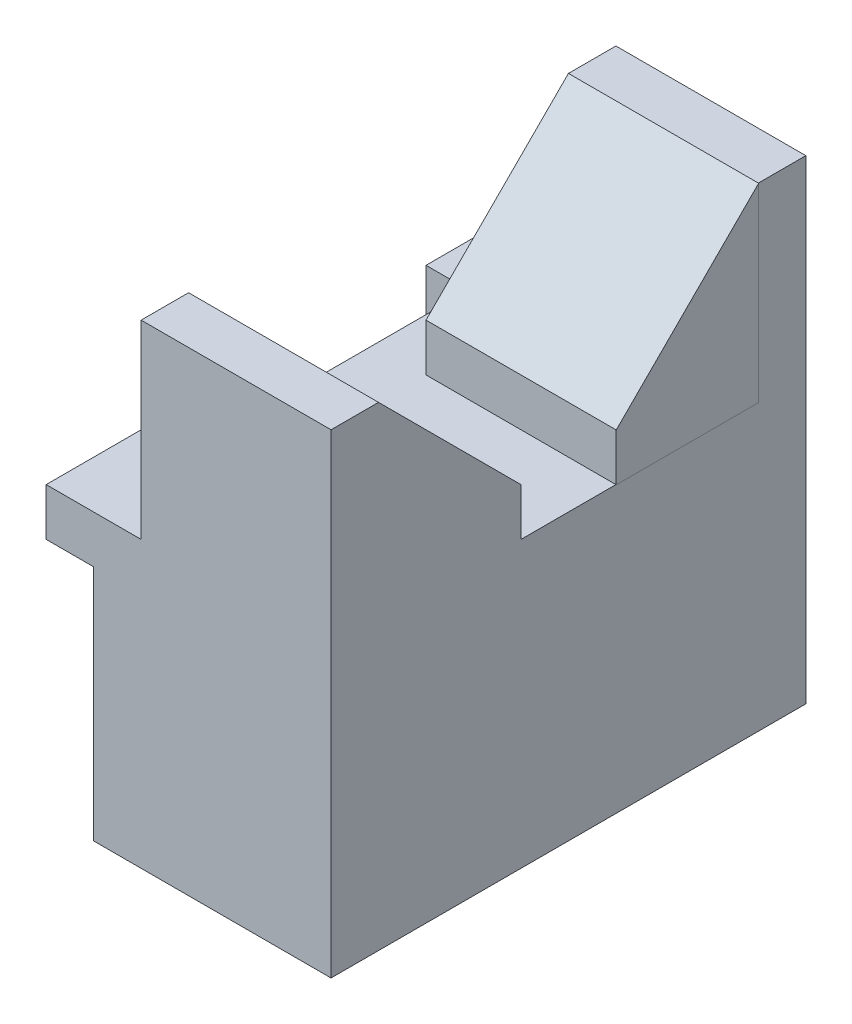
ISO-10303-21;
HEADER;
FILE_DESCRIPTION(('STEP AP214'),'2;1');
FILE_NAME('part.step','',(''),(''),'','','');
FILE_SCHEMA(('AUTOMOTIVE_DESIGN { 1 0 10303 214 1 1 1 1 }'));
ENDSEC;
DATA;
#1=APPLICATION_CONTEXT('core data for automotive mechanical design processes');
#2=APPLICATION_PROTOCOL_DEFINITION('international standard','automotive_design',2000,#1);
#3=PRODUCT_CONTEXT('',#1,'mechanical');
#4=PRODUCT('Part','Part','',(#3));
#5=PRODUCT_RELATED_PRODUCT_CATEGORY('part','',(#4));
#6=PRODUCT_DEFINITION_FORMATION('','',#4);
#7=PRODUCT_DEFINITION_CONTEXT('part definition',#1,'design');
#8=PRODUCT_DEFINITION('design','',#6,#7);
#9=PRODUCT_DEFINITION_SHAPE('','',#8);
#10=(LENGTH_UNIT() NAMED_UNIT(*) SI_UNIT(.MILLI.,.METRE.));
#11=(NAMED_UNIT(*) PLANE_ANGLE_UNIT() SI_UNIT($,.RADIAN.));
#12=(NAMED_UNIT(*) SI_UNIT($,.STERADIAN.) SOLID_ANGLE_UNIT());
#13=UNCERTAINTY_MEASURE_WITH_UNIT(LENGTH_MEASURE(1.E-05),#10,'distance_accuracy_value','');
#14=(GEOMETRIC_REPRESENTATION_CONTEXT(3) GLOBAL_UNCERTAINTY_ASSIGNED_CONTEXT((#13)) GLOBAL_UNIT_ASSIGNED_CONTEXT((#10,
#11,#12)) REPRESENTATION_CONTEXT('',''));
#15=CARTESIAN_POINT('',(0.,0.,0.));
#16=DIRECTION('',(0.,0.,1.));
#17=DIRECTION('',(1.,0.,0.));
#18=AXIS2_PLACEMENT_3D('',#15,#16,#17);
#19=CARTESIAN_POINT('',(0.,30.,0.));
#20=DIRECTION('',(0.,1.,0.));
#21=DIRECTION('',(0.,0.,1.));
#22=AXIS2_PLACEMENT_3D('',#19,#20,#21);
#23=PLANE('',#22);
#24=DIRECTION('',(0.,0.,1.));
#25=VECTOR('',#24,1.);
#26=CARTESIAN_POINT('',(5.00000000000001,30.,35.));
#27=LINE('',#26,#25);
#28=CARTESIAN_POINT('',(5.00000000000001,30.,30.));
#29=VERTEX_POINT('',#28);
#30=CARTESIAN_POINT('',(5.00000000000001,30.,50.));
#31=VERTEX_POINT('',#30);
#32=EDGE_CURVE('E204',#29,#31,#27,.T.);
#33=ORIENTED_EDGE('',*,*,#32,.F.);
#34=DIRECTION('',(-1.,0.,0.));
#35=VECTOR('',#34,1.);
#36=CARTESIAN_POINT('',(25.,30.,30.));
#37=LINE('',#36,#35);
#38=CARTESIAN_POINT('',(25.,30.,30.));
#39=VERTEX_POINT('',#38);
#40=EDGE_CURVE('E375',#39,#29,#37,.T.);
#41=ORIENTED_EDGE('',*,*,#40,.F.);
#42=DIRECTION('',(0.,0.,-1.));
#43=VECTOR('',#42,1.);
#44=CARTESIAN_POINT('',(25.,30.,0.));
#45=LINE('',#44,#43);
#46=CARTESIAN_POINT('',(25.,30.,20.));
#47=VERTEX_POINT('',#46);
#48=EDGE_CURVE('E320',#39,#47,#45,.T.);
#49=ORIENTED_EDGE('',*,*,#48,.T.);
#50=DIRECTION('',(1.,0.,0.));
#51=VECTOR('',#50,1.);
#52=CARTESIAN_POINT('',(5.00000000000001,30.,20.));
#53=LINE('',#52,#51);
#54=CARTESIAN_POINT('',(5.00000000000001,30.,20.));
#55=VERTEX_POINT('',#54);
#56=EDGE_CURVE('E373',#55,#47,#53,.T.);
#57=ORIENTED_EDGE('',*,*,#56,.F.);
#58=DIRECTION('',(0.,0.,1.));
#59=VECTOR('',#58,1.);
#60=CARTESIAN_POINT('',(5.00000000000001,30.,0.));
#61=LINE('',#60,#59);
#62=CARTESIAN_POINT('',(5.00000000000001,30.,0.));
#63=VERTEX_POINT('',#62);
#64=EDGE_CURVE('E197',#63,#55,#61,.T.);
#65=ORIENTED_EDGE('',*,*,#64,.F.);
#66=DIRECTION('',(-1.,0.,0.));
#67=VECTOR('',#66,1.);
#68=CARTESIAN_POINT('',(0.,30.,0.));
#69=LINE('',#68,#67);
#70=CARTESIAN_POINT('',(-5.,30.,0.));
#71=VERTEX_POINT('',#70);
#72=EDGE_CURVE('E323',#63,#71,#69,.T.);
#73=ORIENTED_EDGE('',*,*,#72,.T.);
#74=DIRECTION('',(0.,0.,1.));
#75=VECTOR('',#74,1.);
#76=CARTESIAN_POINT('',(-5.,30.,0.));
#77=LINE('',#76,#75);
#78=CARTESIAN_POINT('',(-5.,30.,10.));
#79=VERTEX_POINT('',#78);
#80=EDGE_CURVE('E290',#71,#79,#77,.T.);
#81=ORIENTED_EDGE('',*,*,#80,.T.);
#82=DIRECTION('',(1.,0.,0.));
#83=VECTOR('',#82,1.);
#84=CARTESIAN_POINT('',(-5.,30.,10.));
#85=LINE('',#84,#83);
#86=CARTESIAN_POINT('',(-0.5,30.,10.));
#87=VERTEX_POINT('',#86);
#88=EDGE_CURVE('E293',#79,#87,#85,.T.);
#89=ORIENTED_EDGE('',*,*,#88,.T.);
#90=DIRECTION('',(0.,0.,-1.));
#91=VECTOR('',#90,1.);
#92=CARTESIAN_POINT('',(-0.499999999999999,30.,10.));
#93=LINE('',#92,#91);
#94=CARTESIAN_POINT('',(-0.499999999999995,30.,40.));
#95=VERTEX_POINT('',#94);
#96=EDGE_CURVE('E255',#95,#87,#93,.T.);
#97=ORIENTED_EDGE('',*,*,#96,.F.);
#98=DIRECTION('',(-1.,0.,0.));
#99=VECTOR('',#98,1.);
#100=CARTESIAN_POINT('',(0.,30.,40.));
#101=LINE('',#100,#99);
#102=CARTESIAN_POINT('',(-5.,30.,40.));
#103=VERTEX_POINT('',#102);
#104=EDGE_CURVE('E263',#95,#103,#101,.T.);
#105=ORIENTED_EDGE('',*,*,#104,.T.);
#106=DIRECTION('',(0.,0.,1.));
#107=VECTOR('',#106,1.);
#108=CARTESIAN_POINT('',(-5.,30.,50.));
#109=LINE('',#108,#107);
#110=CARTESIAN_POINT('',(-5.,30.,50.));
#111=VERTEX_POINT('',#110);
#112=EDGE_CURVE('E268',#103,#111,#109,.T.);
#113=ORIENTED_EDGE('',*,*,#112,.T.);
#114=DIRECTION('',(1.,0.,0.));
#115=VECTOR('',#114,1.);
#116=CARTESIAN_POINT('',(0.,30.,50.));
#117=LINE('',#116,#115);
#118=EDGE_CURVE('E317',#111,#31,#117,.T.);
#119=ORIENTED_EDGE('',*,*,#118,.T.);
#120=EDGE_LOOP('',(#33,#41,#49,#57,#65,#73,#81,#89,#97,#105,#113,#119));
#121=FACE_BOUND('',#120,.T.);
#122=ADVANCED_FACE('F39',(#121),#23,.T.);
#123=CARTESIAN_POINT('',(0.,25.,0.));
#124=DIRECTION('',(1.,0.,0.));
#125=DIRECTION('',(0.,0.,-1.));
#126=AXIS2_PLACEMENT_3D('',#123,#124,#125);
#127=PLANE('',#126);
#128=DIRECTION('',(0.,-1.,0.));
#129=VECTOR('',#128,1.);
#130=CARTESIAN_POINT('',(0.,25.,50.));
#131=LINE('',#130,#129);
#132=CARTESIAN_POINT('',(0.,25.,50.));
#133=VERTEX_POINT('',#132);
#134=CARTESIAN_POINT('',(0.,0.,50.));
#135=VERTEX_POINT('',#134);
#136=EDGE_CURVE('E351',#133,#135,#131,.T.);
#137=ORIENTED_EDGE('',*,*,#136,.F.);
#138=DIRECTION('',(0.,0.,-1.));
#139=VECTOR('',#138,1.);
#140=CARTESIAN_POINT('',(0.,25.,0.));
#141=LINE('',#140,#139);
#142=CARTESIAN_POINT('',(0.,25.,0.));
#143=VERTEX_POINT('',#142);
#144=EDGE_CURVE('E286',#133,#143,#141,.T.);
#145=ORIENTED_EDGE('',*,*,#144,.T.);
#146=DIRECTION('',(0.,-1.,0.));
#147=VECTOR('',#146,1.);
#148=CARTESIAN_POINT('',(0.,25.,0.));
#149=LINE('',#148,#147);
#150=CARTESIAN_POINT('',(0.,0.,0.));
#151=VERTEX_POINT('',#150);
#152=EDGE_CURVE('E341',#143,#151,#149,.T.);
#153=ORIENTED_EDGE('',*,*,#152,.T.);
#154=DIRECTION('',(0.,0.,1.));
#155=VECTOR('',#154,1.);
#156=CARTESIAN_POINT('',(0.,0.,0.));
#157=LINE('',#156,#155);
#158=EDGE_CURVE('E326',#151,#135,#157,.T.);
#159=ORIENTED_EDGE('',*,*,#158,.T.);
#160=EDGE_LOOP('',(#137,#145,#153,#159));
#161=FACE_BOUND('',#160,.T.);
#162=ADVANCED_FACE('F41',(#161),#127,.F.);
#163=CARTESIAN_POINT('',(0.,25.,50.));
#164=DIRECTION('',(0.,0.,-1.));
#165=DIRECTION('',(-1.,0.,0.));
#166=AXIS2_PLACEMENT_3D('',#163,#164,#165);
#167=PLANE('',#166);
#168=DIRECTION('',(0.,-1.,0.));
#169=VECTOR('',#168,1.);
#170=CARTESIAN_POINT('',(5.00000000000001,50.,50.));
#171=LINE('',#170,#169);
#172=CARTESIAN_POINT('',(5.00000000000001,50.,50.));
#173=VERTEX_POINT('',#172);
#174=EDGE_CURVE('E221',#173,#31,#171,.T.);
#175=ORIENTED_EDGE('',*,*,#174,.T.);
#176=ORIENTED_EDGE('',*,*,#118,.F.);
#177=DIRECTION('',(0.,1.,0.));
#178=VECTOR('',#177,1.);
#179=CARTESIAN_POINT('',(-5.,25.,50.));
#180=LINE('',#179,#178);
#181=CARTESIAN_POINT('',(-5.,25.,50.));
#182=VERTEX_POINT('',#181);
#183=EDGE_CURVE('E282',#182,#111,#180,.T.);
#184=ORIENTED_EDGE('',*,*,#183,.F.);
#185=DIRECTION('',(1.,0.,0.));
#186=VECTOR('',#185,1.);
#187=CARTESIAN_POINT('',(0.,25.,50.));
#188=LINE('',#187,#186);
#189=EDGE_CURVE('E272',#182,#133,#188,.T.);
#190=ORIENTED_EDGE('',*,*,#189,.T.);
#191=ORIENTED_EDGE('',*,*,#136,.T.);
#192=DIRECTION('',(1.,0.,0.));
#193=VECTOR('',#192,1.);
#194=CARTESIAN_POINT('',(0.,0.,50.));
#195=LINE('',#194,#193);
#196=CARTESIAN_POINT('',(25.,0.,50.));
#197=VERTEX_POINT('',#196);
#198=EDGE_CURVE('E330',#135,#197,#195,.T.);
#199=ORIENTED_EDGE('',*,*,#198,.T.);
#200=DIRECTION('',(0.,-1.,0.));
#201=VECTOR('',#200,1.);
#202=CARTESIAN_POINT('',(25.,25.,50.));
#203=LINE('',#202,#201);
#204=CARTESIAN_POINT('',(25.,50.,50.));
#205=VERTEX_POINT('',#204);
#206=EDGE_CURVE('E348',#205,#197,#203,.T.);
#207=ORIENTED_EDGE('',*,*,#206,.F.);
#208=DIRECTION('',(1.,0.,0.));
#209=VECTOR('',#208,1.);
#210=CARTESIAN_POINT('',(25.,50.,50.));
#211=LINE('',#210,#209);
#212=EDGE_CURVE('E217',#173,#205,#211,.T.);
#213=ORIENTED_EDGE('',*,*,#212,.F.);
#214=EDGE_LOOP('',(#175,#176,#184,#190,#191,#199,#207,#213));
#215=FACE_BOUND('',#214,.T.);
#216=ADVANCED_FACE('F426',(#215),#167,.F.);
#217=CARTESIAN_POINT('',(25.,25.,0.));
#218=DIRECTION('',(-1.,0.,0.));
#219=DIRECTION('',(0.,0.,1.));
#220=AXIS2_PLACEMENT_3D('',#217,#218,#219);
#221=PLANE('',#220);
#222=DIRECTION('',(0.,-1.,0.));
#223=VECTOR('',#222,1.);
#224=CARTESIAN_POINT('',(25.,50.,30.));
#225=LINE('',#224,#223);
#226=CARTESIAN_POINT('',(25.,35.,30.));
#227=VERTEX_POINT('',#226);
#228=EDGE_CURVE('E359',#227,#39,#225,.T.);
#229=ORIENTED_EDGE('',*,*,#228,.F.);
#230=DIRECTION('',(0.,0.707106781186547,0.707106781186548));
#231=VECTOR('',#230,1.);
#232=CARTESIAN_POINT('',(25.,15.,9.99999999999999));
#233=LINE('',#232,#231);
#234=CARTESIAN_POINT('',(25.,50.,45.));
#235=VERTEX_POINT('',#234);
#236=EDGE_CURVE('E62',#227,#235,#233,.T.);
#237=ORIENTED_EDGE('',*,*,#236,.T.);
#238=DIRECTION('',(0.,0.,-1.));
#239=VECTOR('',#238,1.);
#240=CARTESIAN_POINT('',(25.,50.,35.));
#241=LINE('',#240,#239);
#242=EDGE_CURVE('E210',#205,#235,#241,.T.);
#243=ORIENTED_EDGE('',*,*,#242,.F.);
#244=ORIENTED_EDGE('',*,*,#206,.T.);
#245=DIRECTION('',(0.,0.,-1.));
#246=VECTOR('',#245,1.);
#247=CARTESIAN_POINT('',(25.,0.,0.));
#248=LINE('',#247,#246);
#249=CARTESIAN_POINT('',(25.,0.,0.));
#250=VERTEX_POINT('',#249);
#251=EDGE_CURVE('E334',#197,#250,#248,.T.);
#252=ORIENTED_EDGE('',*,*,#251,.T.);
#253=DIRECTION('',(0.,-1.,0.));
#254=VECTOR('',#253,1.);
#255=CARTESIAN_POINT('',(25.,25.,0.));
#256=LINE('',#255,#254);
#257=CARTESIAN_POINT('',(25.,50.,0.));
#258=VERTEX_POINT('',#257);
#259=EDGE_CURVE('E344',#258,#250,#256,.T.);
#260=ORIENTED_EDGE('',*,*,#259,.F.);
#261=DIRECTION('',(0.,0.,-1.));
#262=VECTOR('',#261,1.);
#263=CARTESIAN_POINT('',(25.,50.,0.));
#264=LINE('',#263,#262);
#265=CARTESIAN_POINT('',(25.,50.,5.));
#266=VERTEX_POINT('',#265);
#267=EDGE_CURVE('E228',#266,#258,#264,.T.);
#268=ORIENTED_EDGE('',*,*,#267,.F.);
#269=DIRECTION('',(0.,-1.,0.));
#270=VECTOR('',#269,1.);
#271=CARTESIAN_POINT('',(25.,50.,5.));
#272=LINE('',#271,#270);
#273=CARTESIAN_POINT('',(25.,30.,5.));
#274=VERTEX_POINT('',#273);
#275=EDGE_CURVE('E238',#266,#274,#272,.T.);
#276=ORIENTED_EDGE('',*,*,#275,.T.);
#277=DIRECTION('',(0.,0.,-1.));
#278=VECTOR('',#277,1.);
#279=CARTESIAN_POINT('',(25.,30.,0.));
#280=LINE('',#279,#278);
#281=EDGE_CURVE('E200',#47,#274,#280,.T.);
#282=ORIENTED_EDGE('',*,*,#281,.F.);
#283=ORIENTED_EDGE('',*,*,#48,.F.);
#284=EDGE_LOOP('',(#229,#237,#243,#244,#252,#260,#268,#276,#282,#283));
#285=FACE_BOUND('',#284,.T.);
#286=ADVANCED_FACE('F365',(#285),#221,.F.);
#287=CARTESIAN_POINT('',(0.,25.,0.));
#288=DIRECTION('',(0.,0.,1.));
#289=DIRECTION('',(1.,0.,0.));
#290=AXIS2_PLACEMENT_3D('',#287,#288,#289);
#291=PLANE('',#290);
#292=DIRECTION('',(-1.,0.,0.));
#293=VECTOR('',#292,1.);
#294=CARTESIAN_POINT('',(0.,0.,0.));
#295=LINE('',#294,#293);
#296=EDGE_CURVE('E337',#250,#151,#295,.T.);
#297=ORIENTED_EDGE('',*,*,#296,.T.);
#298=ORIENTED_EDGE('',*,*,#152,.F.);
#299=DIRECTION('',(-1.,0.,0.));
#300=VECTOR('',#299,1.);
#301=CARTESIAN_POINT('',(0.,25.,0.));
#302=LINE('',#301,#300);
#303=CARTESIAN_POINT('',(-5.,25.,0.));
#304=VERTEX_POINT('',#303);
#305=EDGE_CURVE('E302',#143,#304,#302,.T.);
#306=ORIENTED_EDGE('',*,*,#305,.T.);
#307=DIRECTION('',(0.,-1.,0.));
#308=VECTOR('',#307,1.);
#309=CARTESIAN_POINT('',(-5.,30.,0.));
#310=LINE('',#309,#308);
#311=EDGE_CURVE('E313',#71,#304,#310,.T.);
#312=ORIENTED_EDGE('',*,*,#311,.F.);
#313=ORIENTED_EDGE('',*,*,#72,.F.);
#314=DIRECTION('',(0.,-1.,0.));
#315=VECTOR('',#314,1.);
#316=CARTESIAN_POINT('',(5.00000000000001,50.,0.));
#317=LINE('',#316,#315);
#318=CARTESIAN_POINT('',(5.00000000000001,50.,0.));
#319=VERTEX_POINT('',#318);
#320=EDGE_CURVE('E244',#319,#63,#317,.T.);
#321=ORIENTED_EDGE('',*,*,#320,.F.);
#322=DIRECTION('',(-1.,0.,0.));
#323=VECTOR('',#322,1.);
#324=CARTESIAN_POINT('',(25.,50.,0.));
#325=LINE('',#324,#323);
#326=EDGE_CURVE('E232',#258,#319,#325,.T.);
#327=ORIENTED_EDGE('',*,*,#326,.F.);
#328=ORIENTED_EDGE('',*,*,#259,.T.);
#329=EDGE_LOOP('',(#297,#298,#306,#312,#313,#321,#327,#328));
#330=FACE_BOUND('',#329,.T.);
#331=ADVANCED_FACE('F438',(#330),#291,.F.);
#332=CARTESIAN_POINT('',(0.,0.,0.));
#333=DIRECTION('',(0.,1.,0.));
#334=DIRECTION('',(0.,0.,1.));
#335=AXIS2_PLACEMENT_3D('',#332,#333,#334);
#336=PLANE('',#335);
#337=ORIENTED_EDGE('',*,*,#158,.F.);
#338=ORIENTED_EDGE('',*,*,#296,.F.);
#339=ORIENTED_EDGE('',*,*,#251,.F.);
#340=ORIENTED_EDGE('',*,*,#198,.F.);
#341=EDGE_LOOP('',(#337,#338,#339,#340));
#342=FACE_BOUND('',#341,.T.);
#343=ADVANCED_FACE('F435',(#342),#336,.F.);
#344=CARTESIAN_POINT('',(-5.,30.,0.));
#345=DIRECTION('',(1.,0.,0.));
#346=DIRECTION('',(0.,0.,-1.));
#347=AXIS2_PLACEMENT_3D('',#344,#345,#346);
#348=PLANE('',#347);
#349=DIRECTION('',(0.,0.,1.));
#350=VECTOR('',#349,1.);
#351=CARTESIAN_POINT('',(-5.,25.,0.));
#352=LINE('',#351,#350);
#353=CARTESIAN_POINT('',(-5.,25.,10.));
#354=VERTEX_POINT('',#353);
#355=EDGE_CURVE('E305',#304,#354,#352,.T.);
#356=ORIENTED_EDGE('',*,*,#355,.T.);
#357=DIRECTION('',(0.,-1.,0.));
#358=VECTOR('',#357,1.);
#359=CARTESIAN_POINT('',(-5.,30.,10.));
#360=LINE('',#359,#358);
#361=EDGE_CURVE('E298',#79,#354,#360,.T.);
#362=ORIENTED_EDGE('',*,*,#361,.F.);
#363=ORIENTED_EDGE('',*,*,#80,.F.);
#364=ORIENTED_EDGE('',*,*,#311,.T.);
#365=EDGE_LOOP('',(#356,#362,#363,#364));
#366=FACE_BOUND('',#365,.T.);
#367=ADVANCED_FACE('F446',(#366),#348,.F.);
#368=CARTESIAN_POINT('',(-5.,30.,10.));
#369=DIRECTION('',(0.,0.,-1.));
#370=DIRECTION('',(-1.,0.,0.));
#371=AXIS2_PLACEMENT_3D('',#368,#369,#370);
#372=PLANE('',#371);
#373=DIRECTION('',(1.,0.,0.));
#374=VECTOR('',#373,1.);
#375=CARTESIAN_POINT('',(-5.,25.,10.));
#376=LINE('',#375,#374);
#377=CARTESIAN_POINT('',(-0.499999999999999,25.,10.));
#378=VERTEX_POINT('',#377);
#379=EDGE_CURVE('E294',#354,#378,#376,.T.);
#380=ORIENTED_EDGE('',*,*,#379,.T.);
#381=DIRECTION('',(0.,-1.,0.));
#382=VECTOR('',#381,1.);
#383=CARTESIAN_POINT('',(-0.499999999999999,30.,10.));
#384=LINE('',#383,#382);
#385=EDGE_CURVE('E247',#87,#378,#384,.T.);
#386=ORIENTED_EDGE('',*,*,#385,.F.);
#387=ORIENTED_EDGE('',*,*,#88,.F.);
#388=ORIENTED_EDGE('',*,*,#361,.T.);
#389=EDGE_LOOP('',(#380,#386,#387,#388));
#390=FACE_BOUND('',#389,.T.);
#391=ADVANCED_FACE('F450',(#390),#372,.F.);
#392=CARTESIAN_POINT('',(0.,25.,0.));
#393=DIRECTION('',(0.,1.,0.));
#394=DIRECTION('',(0.,0.,1.));
#395=AXIS2_PLACEMENT_3D('',#392,#393,#394);
#396=PLANE('',#395);
#397=ORIENTED_EDGE('',*,*,#144,.F.);
#398=ORIENTED_EDGE('',*,*,#189,.F.);
#399=DIRECTION('',(0.,0.,1.));
#400=VECTOR('',#399,1.);
#401=CARTESIAN_POINT('',(-5.,25.,50.));
#402=LINE('',#401,#400);
#403=CARTESIAN_POINT('',(-5.,25.,40.));
#404=VERTEX_POINT('',#403);
#405=EDGE_CURVE('E267',#404,#182,#402,.T.);
#406=ORIENTED_EDGE('',*,*,#405,.F.);
#407=DIRECTION('',(-1.,0.,0.));
#408=VECTOR('',#407,1.);
#409=CARTESIAN_POINT('',(0.,25.,40.));
#410=LINE('',#409,#408);
#411=CARTESIAN_POINT('',(-0.499999999999995,25.,40.));
#412=VERTEX_POINT('',#411);
#413=EDGE_CURVE('E264',#412,#404,#410,.T.);
#414=ORIENTED_EDGE('',*,*,#413,.F.);
#415=DIRECTION('',(0.,0.,1.));
#416=VECTOR('',#415,1.);
#417=CARTESIAN_POINT('',(-0.499999999999999,25.,10.));
#418=LINE('',#417,#416);
#419=EDGE_CURVE('E251',#378,#412,#418,.T.);
#420=ORIENTED_EDGE('',*,*,#419,.F.);
#421=ORIENTED_EDGE('',*,*,#379,.F.);
#422=ORIENTED_EDGE('',*,*,#355,.F.);
#423=ORIENTED_EDGE('',*,*,#305,.F.);
#424=EDGE_LOOP('',(#397,#398,#406,#414,#420,#421,#422,#423));
#425=FACE_BOUND('',#424,.T.);
#426=ADVANCED_FACE('F465',(#425),#396,.F.);
#427=CARTESIAN_POINT('',(-5.,25.,50.));
#428=DIRECTION('',(-1.,0.,0.));
#429=DIRECTION('',(0.,0.,1.));
#430=AXIS2_PLACEMENT_3D('',#427,#428,#429);
#431=PLANE('',#430);
#432=ORIENTED_EDGE('',*,*,#112,.F.);
#433=DIRECTION('',(0.,1.,0.));
#434=VECTOR('',#433,1.);
#435=CARTESIAN_POINT('',(-5.,25.,40.));
#436=LINE('',#435,#434);
#437=EDGE_CURVE('E276',#404,#103,#436,.T.);
#438=ORIENTED_EDGE('',*,*,#437,.F.);
#439=ORIENTED_EDGE('',*,*,#405,.T.);
#440=ORIENTED_EDGE('',*,*,#183,.T.);
#441=EDGE_LOOP('',(#432,#438,#439,#440));
#442=FACE_BOUND('',#441,.T.);
#443=ADVANCED_FACE('F461',(#442),#431,.T.);
#444=CARTESIAN_POINT('',(0.,25.,40.));
#445=DIRECTION('',(0.,0.,-1.));
#446=DIRECTION('',(-1.,0.,0.));
#447=AXIS2_PLACEMENT_3D('',#444,#445,#446);
#448=PLANE('',#447);
#449=DIRECTION('',(0.,1.,0.));
#450=VECTOR('',#449,1.);
#451=CARTESIAN_POINT('',(-0.499999999999995,25.,40.));
#452=LINE('',#451,#450);
#453=EDGE_CURVE('E259',#412,#95,#452,.T.);
#454=ORIENTED_EDGE('',*,*,#453,.F.);
#455=ORIENTED_EDGE('',*,*,#413,.T.);
#456=ORIENTED_EDGE('',*,*,#437,.T.);
#457=ORIENTED_EDGE('',*,*,#104,.F.);
#458=EDGE_LOOP('',(#454,#455,#456,#457));
#459=FACE_BOUND('',#458,.T.);
#460=ADVANCED_FACE('F457',(#459),#448,.T.);
#461=CARTESIAN_POINT('',(-0.5,0.,0.));
#462=DIRECTION('',(-1.,0.,0.));
#463=DIRECTION('',(0.,0.,1.));
#464=AXIS2_PLACEMENT_3D('',#461,#462,#463);
#465=PLANE('',#464);
#466=ORIENTED_EDGE('',*,*,#419,.T.);
#467=ORIENTED_EDGE('',*,*,#453,.T.);
#468=ORIENTED_EDGE('',*,*,#96,.T.);
#469=ORIENTED_EDGE('',*,*,#385,.T.);
#470=EDGE_LOOP('',(#466,#467,#468,#469));
#471=FACE_BOUND('',#470,.T.);
#472=ADVANCED_FACE('F453',(#471),#465,.T.);
#473=CARTESIAN_POINT('',(5.00000000000001,50.,0.));
#474=DIRECTION('',(1.,0.,0.));
#475=DIRECTION('',(0.,0.,-1.));
#476=AXIS2_PLACEMENT_3D('',#473,#474,#475);
#477=PLANE('',#476);
#478=DIRECTION('',(0.,-1.,0.));
#479=VECTOR('',#478,1.);
#480=CARTESIAN_POINT('',(5.00000000000001,50.,20.));
#481=LINE('',#480,#479);
#482=CARTESIAN_POINT('',(5.00000000000001,35.,20.));
#483=VERTEX_POINT('',#482);
#484=EDGE_CURVE('E189',#483,#55,#481,.T.);
#485=ORIENTED_EDGE('',*,*,#484,.F.);
#486=DIRECTION('',(0.,-0.707106781186548,0.707106781186547));
#487=VECTOR('',#486,1.);
#488=CARTESIAN_POINT('',(5.00000000000001,35.,20.));
#489=LINE('',#488,#487);
#490=CARTESIAN_POINT('',(5.00000000000001,50.,5.));
#491=VERTEX_POINT('',#490);
#492=EDGE_CURVE('E174',#491,#483,#489,.T.);
#493=ORIENTED_EDGE('',*,*,#492,.F.);
#494=DIRECTION('',(0.,0.,1.));
#495=VECTOR('',#494,1.);
#496=CARTESIAN_POINT('',(5.00000000000001,50.,0.));
#497=LINE('',#496,#495);
#498=EDGE_CURVE('E235',#319,#491,#497,.T.);
#499=ORIENTED_EDGE('',*,*,#498,.F.);
#500=ORIENTED_EDGE('',*,*,#320,.T.);
#501=ORIENTED_EDGE('',*,*,#64,.T.);
#502=EDGE_LOOP('',(#485,#493,#499,#500,#501));
#503=FACE_BOUND('',#502,.T.);
#504=ADVANCED_FACE('F195',(#503),#477,.F.);
#505=CARTESIAN_POINT('',(0.,50.,0.));
#506=DIRECTION('',(0.,-1.,0.));
#507=DIRECTION('',(0.,0.,-1.));
#508=AXIS2_PLACEMENT_3D('',#505,#506,#507);
#509=PLANE('',#508);
#510=ORIENTED_EDGE('',*,*,#498,.T.);
#511=DIRECTION('',(-1.,0.,0.));
#512=VECTOR('',#511,1.);
#513=CARTESIAN_POINT('',(35.,50.,5.));
#514=LINE('',#513,#512);
#515=EDGE_CURVE('E177',#266,#491,#514,.T.);
#516=ORIENTED_EDGE('',*,*,#515,.F.);
#517=ORIENTED_EDGE('',*,*,#267,.T.);
#518=ORIENTED_EDGE('',*,*,#326,.T.);
#519=EDGE_LOOP('',(#510,#516,#517,#518));
#520=FACE_BOUND('',#519,.T.);
#521=ADVANCED_FACE('F405',(#520),#509,.F.);
#522=CARTESIAN_POINT('',(5.00000000000001,50.,35.));
#523=DIRECTION('',(1.,0.,0.));
#524=DIRECTION('',(0.,0.,-1.));
#525=AXIS2_PLACEMENT_3D('',#522,#523,#524);
#526=PLANE('',#525);
#527=DIRECTION('',(0.,0.,1.));
#528=VECTOR('',#527,1.);
#529=CARTESIAN_POINT('',(5.00000000000001,50.,35.));
#530=LINE('',#529,#528);
#531=CARTESIAN_POINT('',(5.00000000000001,50.,45.));
#532=VERTEX_POINT('',#531);
#533=EDGE_CURVE('E214',#532,#173,#530,.T.);
#534=ORIENTED_EDGE('',*,*,#533,.F.);
#535=DIRECTION('',(0.,0.707106781186547,0.707106781186548));
#536=VECTOR('',#535,1.);
#537=CARTESIAN_POINT('',(5.00000000000001,50.,45.));
#538=LINE('',#537,#536);
#539=CARTESIAN_POINT('',(5.00000000000001,35.,30.));
#540=VERTEX_POINT('',#539);
#541=EDGE_CURVE('E412',#540,#532,#538,.T.);
#542=ORIENTED_EDGE('',*,*,#541,.F.);
#543=DIRECTION('',(0.,-1.,0.));
#544=VECTOR('',#543,1.);
#545=CARTESIAN_POINT('',(5.00000000000001,50.,30.));
#546=LINE('',#545,#544);
#547=EDGE_CURVE('E361',#540,#29,#546,.T.);
#548=ORIENTED_EDGE('',*,*,#547,.T.);
#549=ORIENTED_EDGE('',*,*,#32,.T.);
#550=ORIENTED_EDGE('',*,*,#174,.F.);
#551=EDGE_LOOP('',(#534,#542,#548,#549,#550));
#552=FACE_BOUND('',#551,.T.);
#553=ADVANCED_FACE('F423',(#552),#526,.F.);
#554=CARTESIAN_POINT('',(0.,50.,0.));
#555=DIRECTION('',(0.,-1.,0.));
#556=DIRECTION('',(0.,0.,-1.));
#557=AXIS2_PLACEMENT_3D('',#554,#555,#556);
#558=PLANE('',#557);
#559=ORIENTED_EDGE('',*,*,#242,.T.);
#560=DIRECTION('',(-1.,0.,0.));
#561=VECTOR('',#560,1.);
#562=CARTESIAN_POINT('',(35.,50.,45.));
#563=LINE('',#562,#561);
#564=EDGE_CURVE('E183',#235,#532,#563,.T.);
#565=ORIENTED_EDGE('',*,*,#564,.T.);
#566=ORIENTED_EDGE('',*,*,#533,.T.);
#567=ORIENTED_EDGE('',*,*,#212,.T.);
#568=EDGE_LOOP('',(#559,#565,#566,#567));
#569=FACE_BOUND('',#568,.T.);
#570=ADVANCED_FACE('F428',(#569),#558,.F.);
#571=CARTESIAN_POINT('',(0.,30.,0.));
#572=DIRECTION('',(0.,1.,0.));
#573=DIRECTION('',(0.,0.,1.));
#574=AXIS2_PLACEMENT_3D('',#571,#572,#573);
#575=PLANE('',#574);
#576=CARTESIAN_POINT('',(25.0346411961004,30.,20.));
#577=VERTEX_POINT('',#576);
#578=EDGE_CURVE('E369',#47,#577,#53,.T.);
#579=ORIENTED_EDGE('',*,*,#578,.F.);
#580=ORIENTED_EDGE('',*,*,#281,.T.);
#581=DIRECTION('',(-1.,0.,0.));
#582=VECTOR('',#581,1.);
#583=CARTESIAN_POINT('',(5.00000000000001,30.,5.));
#584=LINE('',#583,#582);
#585=CARTESIAN_POINT('',(25.0346411961004,30.,5.));
#586=VERTEX_POINT('',#585);
#587=EDGE_CURVE('E381',#586,#274,#584,.T.);
#588=ORIENTED_EDGE('',*,*,#587,.F.);
#589=DIRECTION('',(0.,0.,-1.));
#590=VECTOR('',#589,1.);
#591=CARTESIAN_POINT('',(25.0346411961004,30.,5.));
#592=LINE('',#591,#590);
#593=EDGE_CURVE('E384',#577,#586,#592,.T.);
#594=ORIENTED_EDGE('',*,*,#593,.F.);
#595=EDGE_LOOP('',(#579,#580,#588,#594));
#596=FACE_BOUND('',#595,.T.);
#597=ADVANCED_FACE('F401',(#596),#575,.F.);
#598=CARTESIAN_POINT('',(5.00000000000001,50.,5.));
#599=DIRECTION('',(0.,0.,1.));
#600=DIRECTION('',(1.,0.,0.));
#601=AXIS2_PLACEMENT_3D('',#598,#599,#600);
#602=PLANE('',#601);
#603=ORIENTED_EDGE('',*,*,#587,.T.);
#604=ORIENTED_EDGE('',*,*,#275,.F.);
#605=DIRECTION('',(-1.,0.,0.));
#606=VECTOR('',#605,1.);
#607=CARTESIAN_POINT('',(5.00000000000001,50.,5.));
#608=LINE('',#607,#606);
#609=CARTESIAN_POINT('',(25.0346411961004,50.,5.));
#610=VERTEX_POINT('',#609);
#611=EDGE_CURVE('E379',#610,#266,#608,.T.);
#612=ORIENTED_EDGE('',*,*,#611,.F.);
#613=DIRECTION('',(0.,-1.,0.));
#614=VECTOR('',#613,1.);
#615=CARTESIAN_POINT('',(25.0346411961004,50.,5.));
#616=LINE('',#615,#614);
#617=EDGE_CURVE('E206',#610,#586,#616,.T.);
#618=ORIENTED_EDGE('',*,*,#617,.T.);
#619=EDGE_LOOP('',(#603,#604,#612,#618));
#620=FACE_BOUND('',#619,.T.);
#621=ADVANCED_FACE('F395',(#620),#602,.F.);
#622=CARTESIAN_POINT('',(5.00000000000001,50.,20.));
#623=DIRECTION('',(0.,0.,-1.));
#624=DIRECTION('',(-1.,0.,0.));
#625=AXIS2_PLACEMENT_3D('',#622,#623,#624);
#626=PLANE('',#625);
#627=DIRECTION('',(0.,-1.,0.));
#628=VECTOR('',#627,1.);
#629=CARTESIAN_POINT('',(25.0346411961004,50.,20.));
#630=LINE('',#629,#628);
#631=CARTESIAN_POINT('',(25.0346411961004,35.,20.));
#632=VERTEX_POINT('',#631);
#633=EDGE_CURVE('E192',#632,#577,#630,.T.);
#634=ORIENTED_EDGE('',*,*,#633,.F.);
#635=DIRECTION('',(-1.,0.,0.));
#636=VECTOR('',#635,1.);
#637=CARTESIAN_POINT('',(35.,35.,20.));
#638=LINE('',#637,#636);
#639=EDGE_CURVE('E55',#632,#483,#638,.T.);
#640=ORIENTED_EDGE('',*,*,#639,.T.);
#641=ORIENTED_EDGE('',*,*,#484,.T.);
#642=ORIENTED_EDGE('',*,*,#56,.T.);
#643=ORIENTED_EDGE('',*,*,#578,.T.);
#644=EDGE_LOOP('',(#634,#640,#641,#642,#643));
#645=FACE_BOUND('',#644,.T.);
#646=ADVANCED_FACE('F187',(#645),#626,.F.);
#647=CARTESIAN_POINT('',(25.0346411961004,50.,5.));
#648=DIRECTION('',(-1.,0.,0.));
#649=DIRECTION('',(0.,0.,1.));
#650=AXIS2_PLACEMENT_3D('',#647,#648,#649);
#651=PLANE('',#650);
#652=ORIENTED_EDGE('',*,*,#617,.F.);
#653=DIRECTION('',(0.,-0.707106781186548,0.707106781186547));
#654=VECTOR('',#653,1.);
#655=CARTESIAN_POINT('',(25.0346411961004,50.,5.));
#656=LINE('',#655,#654);
#657=EDGE_CURVE('E11',#610,#632,#656,.T.);
#658=ORIENTED_EDGE('',*,*,#657,.T.);
#659=ORIENTED_EDGE('',*,*,#633,.T.);
#660=ORIENTED_EDGE('',*,*,#593,.T.);
#661=EDGE_LOOP('',(#652,#658,#659,#660));
#662=FACE_BOUND('',#661,.T.);
#663=ADVANCED_FACE('F584',(#662),#651,.F.);
#664=CARTESIAN_POINT('',(25.,50.,30.));
#665=DIRECTION('',(0.,0.,1.));
#666=DIRECTION('',(1.,0.,0.));
#667=AXIS2_PLACEMENT_3D('',#664,#665,#666);
#668=PLANE('',#667);
#669=ORIENTED_EDGE('',*,*,#547,.F.);
#670=DIRECTION('',(1.,0.,0.));
#671=VECTOR('',#670,1.);
#672=CARTESIAN_POINT('',(25.,35.,30.));
#673=LINE('',#672,#671);
#674=EDGE_CURVE('E48',#540,#227,#673,.T.);
#675=ORIENTED_EDGE('',*,*,#674,.T.);
#676=ORIENTED_EDGE('',*,*,#228,.T.);
#677=ORIENTED_EDGE('',*,*,#40,.T.);
#678=EDGE_LOOP('',(#669,#675,#676,#677));
#679=FACE_BOUND('',#678,.T.);
#680=ADVANCED_FACE('F357',(#679),#668,.F.);
#681=CARTESIAN_POINT('',(35.,50.,45.));
#682=DIRECTION('',(0.,-0.707106781186548,0.707106781186547));
#683=DIRECTION('',(0.,-0.707106781186547,-0.707106781186548));
#684=AXIS2_PLACEMENT_3D('',#681,#682,#683);
#685=PLANE('',#684);
#686=ORIENTED_EDGE('',*,*,#674,.F.);
#687=ORIENTED_EDGE('',*,*,#541,.T.);
#688=ORIENTED_EDGE('',*,*,#564,.F.);
#689=ORIENTED_EDGE('',*,*,#236,.F.);
#690=EDGE_LOOP('',(#686,#687,#688,#689));
#691=FACE_BOUND('',#690,.T.);
#692=ADVANCED_FACE('F597',(#691),#685,.F.);
#693=CARTESIAN_POINT('',(35.,35.,20.));
#694=DIRECTION('',(0.,-0.707106781186547,-0.707106781186548));
#695=DIRECTION('',(0.,0.707106781186548,-0.707106781186547));
#696=AXIS2_PLACEMENT_3D('',#693,#694,#695);
#697=PLANE('',#696);
#698=ORIENTED_EDGE('',*,*,#611,.T.);
#699=ORIENTED_EDGE('',*,*,#515,.T.);
#700=ORIENTED_EDGE('',*,*,#492,.T.);
#701=ORIENTED_EDGE('',*,*,#639,.F.);
#702=ORIENTED_EDGE('',*,*,#657,.F.);
#703=EDGE_LOOP('',(#698,#699,#700,#701,#702));
#704=FACE_BOUND('',#703,.T.);
#705=ADVANCED_FACE('F175',(#704),#697,.F.);
#706=CLOSED_SHELL('',(#122,#162,#216,#286,#331,#343,#367,#391,#426,#443,#460,#472,#504,#521,
#553,#570,#597,#621,#646,#663,#680,#692,#705));
#707=MANIFOLD_SOLID_BREP('B2',#706);
#708=ADVANCED_BREP_SHAPE_REPRESENTATION('',(#18,#707),#14);
#709=SHAPE_DEFINITION_REPRESENTATION(#9,#708);
ENDSEC;
END-ISO-10303-21;
